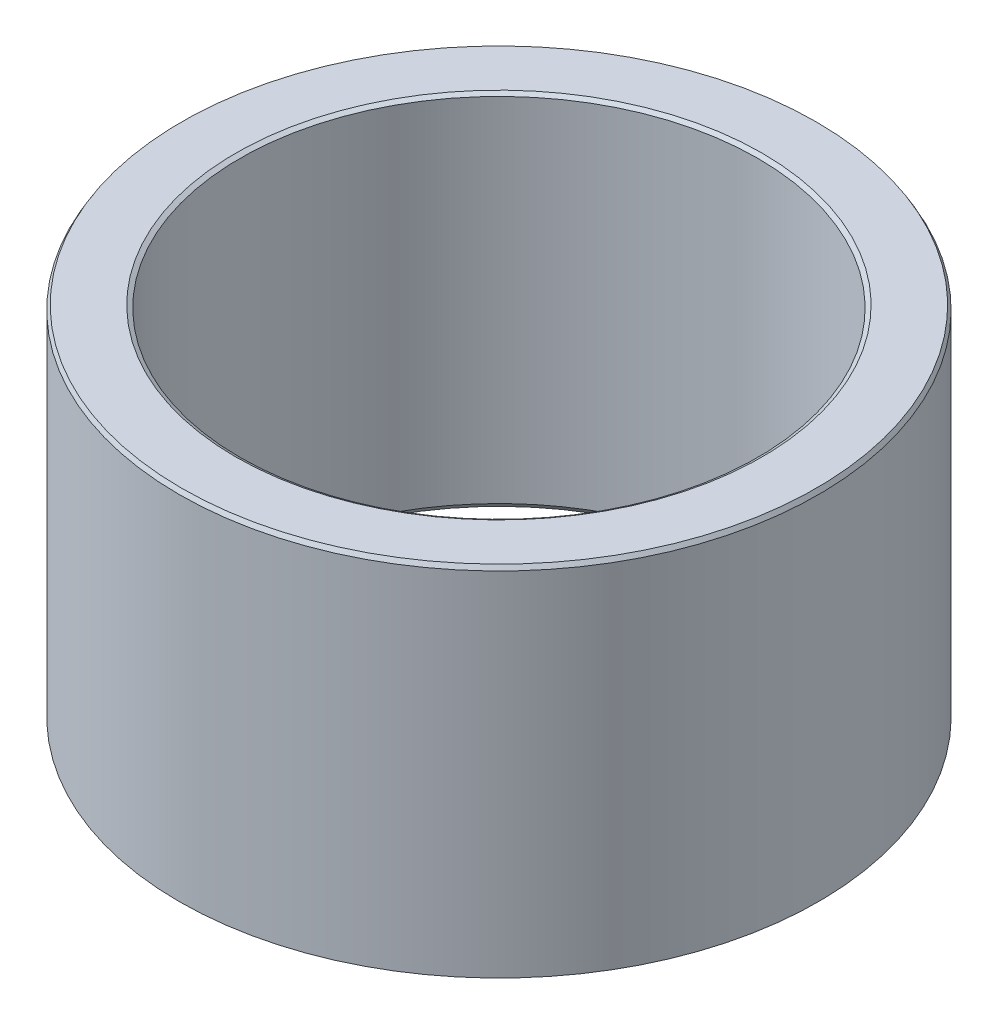
ISO-10303-21;
HEADER;
FILE_DESCRIPTION(('STEP AP214'),'2;1');
FILE_NAME('part.step','',(''),(''),'','','');
FILE_SCHEMA(('AUTOMOTIVE_DESIGN { 1 0 10303 214 1 1 1 1 }'));
ENDSEC;
DATA;
#1=APPLICATION_CONTEXT('core data for automotive mechanical design processes');
#2=APPLICATION_PROTOCOL_DEFINITION('international standard','automotive_design',2000,#1);
#3=PRODUCT_CONTEXT('',#1,'mechanical');
#4=PRODUCT('Part','Part','',(#3));
#5=PRODUCT_RELATED_PRODUCT_CATEGORY('part','',(#4));
#6=PRODUCT_DEFINITION_FORMATION('','',#4);
#7=PRODUCT_DEFINITION_CONTEXT('part definition',#1,'design');
#8=PRODUCT_DEFINITION('design','',#6,#7);
#9=PRODUCT_DEFINITION_SHAPE('','',#8);
#10=(LENGTH_UNIT() NAMED_UNIT(*) SI_UNIT(.MILLI.,.METRE.));
#11=(NAMED_UNIT(*) PLANE_ANGLE_UNIT() SI_UNIT($,.RADIAN.));
#12=(NAMED_UNIT(*) SI_UNIT($,.STERADIAN.) SOLID_ANGLE_UNIT());
#13=UNCERTAINTY_MEASURE_WITH_UNIT(LENGTH_MEASURE(1.E-05),#10,'distance_accuracy_value','');
#14=(GEOMETRIC_REPRESENTATION_CONTEXT(3) GLOBAL_UNCERTAINTY_ASSIGNED_CONTEXT((#13)) GLOBAL_UNIT_ASSIGNED_CONTEXT((#10,
#11,#12)) REPRESENTATION_CONTEXT('',''));
#15=CARTESIAN_POINT('',(0.,0.,0.));
#16=DIRECTION('',(0.,0.,1.));
#17=DIRECTION('',(1.,0.,0.));
#18=AXIS2_PLACEMENT_3D('',#15,#16,#17);
#19=CARTESIAN_POINT('',(0.,33.7031677071951,0.));
#20=DIRECTION('',(0.,-1.,0.));
#21=DIRECTION('',(0.,0.,-1.));
#22=AXIS2_PLACEMENT_3D('',#19,#20,#21);
#23=CYLINDRICAL_SURFACE('',#22,30.);
#24=CARTESIAN_POINT('',(0.,0.229181068101957,0.));
#25=DIRECTION('',(0.,1.,0.));
#26=DIRECTION('',(0.,0.,1.));
#27=AXIS2_PLACEMENT_3D('',#24,#25,#26);
#28=CIRCLE('',#27,30.);
#29=CARTESIAN_POINT('',(0.,0.229181068101957,30.));
#30=VERTEX_POINT('',#29);
#31=EDGE_CURVE('E10',#30,#30,#28,.T.);
#32=ORIENTED_EDGE('',*,*,#31,.T.);
#33=EDGE_LOOP('',(#32));
#34=FACE_BOUND('',#33,.T.);
#35=CARTESIAN_POINT('',(0.,33.3062144531096,0.));
#36=DIRECTION('',(0.,1.,0.));
#37=DIRECTION('',(0.,0.,1.));
#38=AXIS2_PLACEMENT_3D('',#35,#36,#37);
#39=CIRCLE('',#38,30.);
#40=CARTESIAN_POINT('',(0.,33.3062144531096,30.));
#41=VERTEX_POINT('',#40);
#42=EDGE_CURVE('E50',#41,#41,#39,.F.);
#43=ORIENTED_EDGE('',*,*,#42,.T.);
#44=EDGE_LOOP('',(#43));
#45=FACE_BOUND('',#44,.T.);
#46=ADVANCED_FACE('F39',(#34,#45),#23,.T.);
#47=CARTESIAN_POINT('',(0.,33.7031677071951,0.));
#48=DIRECTION('',(0.,1.,0.));
#49=DIRECTION('',(0.,0.,1.));
#50=AXIS2_PLACEMENT_3D('',#47,#48,#49);
#51=PLANE('',#50);
#52=CARTESIAN_POINT('',(0.,33.7031677071951,0.));
#53=DIRECTION('',(0.,1.,0.));
#54=DIRECTION('',(0.,0.,1.));
#55=AXIS2_PLACEMENT_3D('',#52,#53,#54);
#56=CIRCLE('',#55,24.6934247144909);
#57=CARTESIAN_POINT('',(0.,33.7031677071951,24.6934247144909));
#58=VERTEX_POINT('',#57);
#59=EDGE_CURVE('E58',#58,#58,#56,.F.);
#60=ORIENTED_EDGE('',*,*,#59,.T.);
#61=EDGE_LOOP('',(#60));
#62=FACE_BOUND('',#61,.T.);
#63=CARTESIAN_POINT('',(0.,33.7031677071951,0.));
#64=DIRECTION('',(0.,1.,0.));
#65=DIRECTION('',(0.,0.,1.));
#66=AXIS2_PLACEMENT_3D('',#63,#64,#65);
#67=CIRCLE('',#66,29.770818931898);
#68=CARTESIAN_POINT('',(0.,33.7031677071951,29.770818931898));
#69=VERTEX_POINT('',#68);
#70=EDGE_CURVE('E61',#69,#69,#67,.T.);
#71=ORIENTED_EDGE('',*,*,#70,.T.);
#72=EDGE_LOOP('',(#71));
#73=FACE_BOUND('',#72,.T.);
#74=ADVANCED_FACE('F88',(#62,#73),#51,.T.);
#75=CARTESIAN_POINT('',(0.,0.,0.));
#76=DIRECTION('',(0.,1.,0.));
#77=DIRECTION('',(0.,0.,1.));
#78=AXIS2_PLACEMENT_3D('',#75,#76,#77);
#79=PLANE('',#78);
#80=CARTESIAN_POINT('',(0.,0.,0.));
#81=DIRECTION('',(0.,1.,0.));
#82=DIRECTION('',(0.,0.,1.));
#83=AXIS2_PLACEMENT_3D('',#80,#81,#82);
#84=CIRCLE('',#83,24.5256525285073);
#85=CARTESIAN_POINT('',(0.,0.,24.5256525285073));
#86=VERTEX_POINT('',#85);
#87=EDGE_CURVE('E51',#86,#86,#84,.T.);
#88=ORIENTED_EDGE('',*,*,#87,.T.);
#89=EDGE_LOOP('',(#88));
#90=FACE_BOUND('',#89,.T.);
#91=CARTESIAN_POINT('',(0.,0.,0.));
#92=DIRECTION('',(0.,1.,0.));
#93=DIRECTION('',(0.,0.,1.));
#94=AXIS2_PLACEMENT_3D('',#91,#92,#93);
#95=CIRCLE('',#94,29.6030467459145);
#96=CARTESIAN_POINT('',(0.,0.,29.6030467459145));
#97=VERTEX_POINT('',#96);
#98=EDGE_CURVE('E54',#97,#97,#95,.F.);
#99=ORIENTED_EDGE('',*,*,#98,.T.);
#100=EDGE_LOOP('',(#99));
#101=FACE_BOUND('',#100,.T.);
#102=ADVANCED_FACE('F83',(#90,#101),#79,.F.);
#103=CARTESIAN_POINT('',(0.,33.7031677071951,0.));
#104=DIRECTION('',(0.,-1.,0.));
#105=DIRECTION('',(0.,0.,-1.));
#106=AXIS2_PLACEMENT_3D('',#103,#104,#105);
#107=CYLINDRICAL_SURFACE('',#106,24.2964714604053);
#108=CARTESIAN_POINT('',(0.,33.4739866390932,0.));
#109=DIRECTION('',(0.,1.,0.));
#110=DIRECTION('',(0.,0.,1.));
#111=AXIS2_PLACEMENT_3D('',#108,#109,#110);
#112=CIRCLE('',#111,24.2964714604053);
#113=CARTESIAN_POINT('',(0.,33.4739866390932,24.2964714604053));
#114=VERTEX_POINT('',#113);
#115=EDGE_CURVE('E67',#114,#114,#112,.T.);
#116=ORIENTED_EDGE('',*,*,#115,.T.);
#117=EDGE_LOOP('',(#116));
#118=FACE_BOUND('',#117,.T.);
#119=CARTESIAN_POINT('',(0.,0.396953254085508,0.));
#120=DIRECTION('',(0.,1.,0.));
#121=DIRECTION('',(0.,0.,1.));
#122=AXIS2_PLACEMENT_3D('',#119,#120,#121);
#123=CIRCLE('',#122,24.2964714604053);
#124=CARTESIAN_POINT('',(0.,0.396953254085508,24.2964714604053));
#125=VERTEX_POINT('',#124);
#126=EDGE_CURVE('E69',#125,#125,#123,.F.);
#127=ORIENTED_EDGE('',*,*,#126,.T.);
#128=EDGE_LOOP('',(#127));
#129=FACE_BOUND('',#128,.T.);
#130=ADVANCED_FACE('F71',(#118,#129),#107,.F.);
#131=CARTESIAN_POINT('',(0.,33.4739866390932,0.));
#132=DIRECTION('',(0.,1.,0.));
#133=DIRECTION('',(0.,0.,1.));
#134=AXIS2_PLACEMENT_3D('',#131,#132,#133);
#135=CONICAL_SURFACE('',#134,24.2964714604053,1.0471975511966);
#136=CARTESIAN_POINT('',(0.,33.7031677071951,24.6934247144909));
#137=CARTESIAN_POINT('',(0.,33.7007804044024,24.6892897847608));
#138=CARTESIAN_POINT('',(0.,33.6983931016097,24.6851548550307));
#139=CARTESIAN_POINT('',(0.,33.6936184960242,24.6768849955706));
#140=CARTESIAN_POINT('',(0.,33.6912311932315,24.6727500658406));
#141=CARTESIAN_POINT('',(0.,33.686456587646,24.6644802063804));
#142=CARTESIAN_POINT('',(0.,33.6840692848533,24.6603452766504));
#143=CARTESIAN_POINT('',(0.,33.6792946792679,24.6520754171903));
#144=CARTESIAN_POINT('',(0.,33.6769073764751,24.6479404874602));
#145=CARTESIAN_POINT('',(0.,33.6721327708897,24.6396706280001));
#146=CARTESIAN_POINT('',(0.,33.6697454680969,24.6355356982701));
#147=CARTESIAN_POINT('',(0.,33.6649708625115,24.6272658388099));
#148=CARTESIAN_POINT('',(0.,33.6625835597188,24.6231309090799));
#149=CARTESIAN_POINT('',(0.,33.6578089541333,24.6148610496198));
#150=CARTESIAN_POINT('',(0.,33.6554216513406,24.6107261198897));
#151=CARTESIAN_POINT('',(0.,33.6506470457551,24.6024562604296));
#152=CARTESIAN_POINT('',(0.,33.6482597429624,24.5983213306995));
#153=CARTESIAN_POINT('',(0.,33.6434851373769,24.5900514712394));
#154=CARTESIAN_POINT('',(0.,33.6410978345842,24.5859165415094));
#155=CARTESIAN_POINT('',(0.,33.6363232289987,24.5776466820492));
#156=CARTESIAN_POINT('',(0.,33.633935926206,24.5735117523192));
#157=CARTESIAN_POINT('',(0.,33.6291613206205,24.5652418928591));
#158=CARTESIAN_POINT('',(0.,33.6267740178278,24.561106963129));
#159=CARTESIAN_POINT('',(0.,33.6219994122424,24.5528371036689));
#160=CARTESIAN_POINT('',(0.,33.6196121094496,24.5487021739388));
#161=CARTESIAN_POINT('',(0.,33.6148375038642,24.5404323144787));
#162=CARTESIAN_POINT('',(0.,33.6124502010714,24.5362973847487));
#163=CARTESIAN_POINT('',(0.,33.607675595486,24.5280275252885));
#164=CARTESIAN_POINT('',(0.,33.6052882926933,24.5238925955585));
#165=CARTESIAN_POINT('',(0.,33.6005136871078,24.5156227360984));
#166=CARTESIAN_POINT('',(0.,33.5981263843151,24.5114878063683));
#167=CARTESIAN_POINT('',(0.,33.5933517787296,24.5032179469082));
#168=CARTESIAN_POINT('',(0.,33.5909644759369,24.4990830171781));
#169=CARTESIAN_POINT('',(0.,33.5861898703514,24.490813157718));
#170=CARTESIAN_POINT('',(0.,33.5838025675587,24.486678227988));
#171=CARTESIAN_POINT('',(0.,33.5790279619732,24.4784083685279));
#172=CARTESIAN_POINT('',(0.,33.5766406591805,24.4742734387978));
#173=CARTESIAN_POINT('',(0.,33.5718660535951,24.4660035793377));
#174=CARTESIAN_POINT('',(0.,33.5694787508023,24.4618686496076));
#175=CARTESIAN_POINT('',(0.,33.5647041452169,24.4535987901475));
#176=CARTESIAN_POINT('',(0.,33.5623168424241,24.4494638604174));
#177=CARTESIAN_POINT('',(0.,33.5575422368387,24.4411940009573));
#178=CARTESIAN_POINT('',(0.,33.555154934046,24.4370590712273));
#179=CARTESIAN_POINT('',(0.,33.5503803284605,24.4287892117672));
#180=CARTESIAN_POINT('',(0.,33.5479930256678,24.4246542820371));
#181=CARTESIAN_POINT('',(0.,33.5432184200823,24.416384422577));
#182=CARTESIAN_POINT('',(0.,33.5408311172896,24.4122494928469));
#183=CARTESIAN_POINT('',(0.,33.5360565117041,24.4039796333868));
#184=CARTESIAN_POINT('',(0.,33.5336692089114,24.3998447036568));
#185=CARTESIAN_POINT('',(0.,33.5288946033259,24.3915748441966));
#186=CARTESIAN_POINT('',(0.,33.5265073005332,24.3874399144666));
#187=CARTESIAN_POINT('',(0.,33.5217326949477,24.3791700550065));
#188=CARTESIAN_POINT('',(0.,33.519345392155,24.3750351252764));
#189=CARTESIAN_POINT('',(0.,33.5145707865695,24.3667652658163));
#190=CARTESIAN_POINT('',(0.,33.5121834837768,24.3626303360862));
#191=CARTESIAN_POINT('',(0.,33.5074088781914,24.3543604766261));
#192=CARTESIAN_POINT('',(0.,33.5050215753986,24.3502255468961));
#193=CARTESIAN_POINT('',(0.,33.5002469698132,24.3419556874359));
#194=CARTESIAN_POINT('',(0.,33.4978596670204,24.3378207577059));
#195=CARTESIAN_POINT('',(0.,33.493085061435,24.3295508982458));
#196=CARTESIAN_POINT('',(0.,33.4906977586423,24.3254159685157));
#197=CARTESIAN_POINT('',(0.,33.4859231530568,24.3171461090556));
#198=CARTESIAN_POINT('',(0.,33.4835358502641,24.3130111793255));
#199=CARTESIAN_POINT('',(0.,33.4787612446786,24.3047413198654));
#200=CARTESIAN_POINT('',(0.,33.4763739418859,24.3006063901354));
#201=CARTESIAN_POINT('',(0.,33.4739866390932,24.2964714604053));
#202=B_SPLINE_CURVE_WITH_KNOTS('',3,(#136,#137,#138,#139,#140,#141,#142,#143,#144,#145,#146,
#147,#148,#149,#150,#151,#152,#153,#154,#155,#156,#157,#158,#159,#160,#161,#162,#163,#164,#165,
#166,#167,#168,#169,#170,#171,#172,#173,#174,#175,#176,#177,#178,#179,#180,#181,#182,#183,#184,
#185,#186,#187,#188,#189,#190,#191,#192,#193,#194,#195,#196,#197,#198,#199,#200,#201),
.UNSPECIFIED.,.F.,.F.,(4,2,2,2,2,2,2,2,2,2,2,2,2,2,2,2,2,2,2,2,2,2,2,2,2,2,2,2,2,2,2,2,4),(0.,
0.014323816756375,0.0286476335127465,0.0429714502691246,0.0572952670254961,0.0716190837818711,
0.0859429005382456,0.100266717294621,0.114590534050992,0.12891435080737,0.143238167563742,
0.157561984320117,0.171885801076488,0.186209617832866,0.200533434589238,0.214857251345613,
0.229181068101987,0.243504884858359,0.257828701614734,0.272152518371108,0.286476335127483,
0.300800151883855,0.315123968640233,0.329447785396604,0.343771602152979,0.358095418909354,
0.372419235665729,0.3867430524221,0.401066869178476,0.41539068593485,0.429714502691225,
0.444038319447597,0.458362136203971),.UNSPECIFIED.);
#203=EDGE_CURVE('BSEAM77',#58,#114,#202,.T.);
#204=ORIENTED_EDGE('',*,*,#59,.F.);
#205=ORIENTED_EDGE('',*,*,#115,.F.);
#206=ORIENTED_EDGE('',*,*,#203,.T.);
#207=ORIENTED_EDGE('',*,*,#203,.F.);
#208=EDGE_LOOP('',(#204,#206,#205,#207));
#209=FACE_BOUND('',#208,.T.);
#210=ADVANCED_FACE('F77',(#209),#135,.F.);
#211=CARTESIAN_POINT('',(0.,0.,0.));
#212=DIRECTION('',(0.,-1.,0.));
#213=DIRECTION('',(0.,0.,-1.));
#214=AXIS2_PLACEMENT_3D('',#211,#212,#213);
#215=CONICAL_SURFACE('',#214,24.5256525285073,0.523598775598307);
#216=ORIENTED_EDGE('',*,*,#126,.F.);
#217=EDGE_LOOP('',(#216));
#218=FACE_BOUND('',#217,.T.);
#219=ORIENTED_EDGE('',*,*,#87,.F.);
#220=EDGE_LOOP('',(#219));
#221=FACE_BOUND('',#220,.T.);
#222=ADVANCED_FACE('F73',(#218,#221),#215,.F.);
#223=CARTESIAN_POINT('',(0.,0.229181068101957,0.));
#224=DIRECTION('',(0.,1.,0.));
#225=DIRECTION('',(0.,0.,1.));
#226=AXIS2_PLACEMENT_3D('',#223,#224,#225);
#227=CONICAL_SURFACE('',#226,30.,1.0471975511966);
#228=CARTESIAN_POINT('',(0.,0.,29.6030467459145));
#229=CARTESIAN_POINT('',(0.,0.0023873027927286,29.6071816756446));
#230=CARTESIAN_POINT('',(0.,0.00477460558545735,29.6113166053746));
#231=CARTESIAN_POINT('',(0.,0.00954921117091487,29.6195864648347));
#232=CARTESIAN_POINT('',(0.,0.0119365139636436,29.6237213945648));
#233=CARTESIAN_POINT('',(0.,0.0167111195491009,29.6319912540249));
#234=CARTESIAN_POINT('',(0.,0.0190984223418294,29.636126183755));
#235=CARTESIAN_POINT('',(0.,0.0238730279272869,29.6443960432151));
#236=CARTESIAN_POINT('',(0.,0.026260330720016,29.6485309729451));
#237=CARTESIAN_POINT('',(0.,0.0310349363054736,29.6568008324052));
#238=CARTESIAN_POINT('',(0.,0.0334222390982021,29.6609357621353));
#239=CARTESIAN_POINT('',(0.,0.0381968446836593,29.6692056215954));
#240=CARTESIAN_POINT('',(0.,0.0405841474763881,29.6733405513255));
#241=CARTESIAN_POINT('',(0.,0.0453587530618456,29.6816104107856));
#242=CARTESIAN_POINT('',(0.,0.0477460558545743,29.6857453405156));
#243=CARTESIAN_POINT('',(0.,0.0525206614400317,29.6940151999758));
#244=CARTESIAN_POINT('',(0.,0.0549079642327604,29.6981501297058));
#245=CARTESIAN_POINT('',(0.,0.0596825698182178,29.7064199891659));
#246=CARTESIAN_POINT('',(0.,0.0620698726109465,29.710554918896));
#247=CARTESIAN_POINT('',(0.,0.066844478196404,29.7188247783561));
#248=CARTESIAN_POINT('',(0.,0.0692317809891328,29.7229597080862));
#249=CARTESIAN_POINT('',(0.,0.07400638657459,29.7312295675463));
#250=CARTESIAN_POINT('',(0.,0.0763936893673185,29.7353644972763));
#251=CARTESIAN_POINT('',(0.,0.0811682949527761,29.7436343567365));
#252=CARTESIAN_POINT('',(0.,0.0835555977455052,29.7477692864665));
#253=CARTESIAN_POINT('',(0.,0.0883302033309627,29.7560391459266));
#254=CARTESIAN_POINT('',(0.,0.0907175061236912,29.7601740756567));
#255=CARTESIAN_POINT('',(0.,0.0954921117091485,29.7684439351168));
#256=CARTESIAN_POINT('',(0.,0.0978794145018773,29.7725788648469));
#257=CARTESIAN_POINT('',(0.,0.102654020087335,29.780848724307));
#258=CARTESIAN_POINT('',(0.,0.105041322880063,29.784983654037));
#259=CARTESIAN_POINT('',(0.,0.109815928465521,29.7932535134971));
#260=CARTESIAN_POINT('',(0.,0.11220323125825,29.7973884432272));
#261=CARTESIAN_POINT('',(0.,0.116977836843707,29.8056583026873));
#262=CARTESIAN_POINT('',(0.,0.119365139636436,29.8097932324174));
#263=CARTESIAN_POINT('',(0.,0.124139745221893,29.8180630918775));
#264=CARTESIAN_POINT('',(0.,0.126527048014622,29.8221980216075));
#265=CARTESIAN_POINT('',(0.,0.131301653600079,29.8304678810677));
#266=CARTESIAN_POINT('',(0.,0.133688956392808,29.8346028107977));
#267=CARTESIAN_POINT('',(0.,0.138463561978265,29.8428726702578));
#268=CARTESIAN_POINT('',(0.,0.140850864770994,29.8470075999879));
#269=CARTESIAN_POINT('',(0.,0.145625470356452,29.855277459448));
#270=CARTESIAN_POINT('',(0.,0.14801277314918,29.8594123891781));
#271=CARTESIAN_POINT('',(0.,0.152787378734638,29.8676822486382));
#272=CARTESIAN_POINT('',(0.,0.155174681527366,29.8718171783682));
#273=CARTESIAN_POINT('',(0.,0.159949287112824,29.8800870378283));
#274=CARTESIAN_POINT('',(0.,0.162336589905553,29.8842219675584));
#275=CARTESIAN_POINT('',(0.,0.16711119549101,29.8924918270185));
#276=CARTESIAN_POINT('',(0.,0.169498498283739,29.8966267567486));
#277=CARTESIAN_POINT('',(0.,0.174273103869196,29.9048966162087));
#278=CARTESIAN_POINT('',(0.,0.176660406661925,29.9090315459387));
#279=CARTESIAN_POINT('',(0.,0.181435012247382,29.9173014053989));
#280=CARTESIAN_POINT('',(0.,0.183822315040111,29.9214363351289));
#281=CARTESIAN_POINT('',(0.,0.188596920625568,29.929706194589));
#282=CARTESIAN_POINT('',(0.,0.190984223418297,29.9338411243191));
#283=CARTESIAN_POINT('',(0.,0.195758829003754,29.9421109837792));
#284=CARTESIAN_POINT('',(0.,0.198146131796483,29.9462459135093));
#285=CARTESIAN_POINT('',(0.,0.202920737381941,29.9545157729694));
#286=CARTESIAN_POINT('',(0.,0.205308040174669,29.9586507026994));
#287=CARTESIAN_POINT('',(0.,0.210082645760127,29.9669205621595));
#288=CARTESIAN_POINT('',(0.,0.212469948552856,29.9710554918896));
#289=CARTESIAN_POINT('',(0.,0.217244554138313,29.9793253513497));
#290=CARTESIAN_POINT('',(0.,0.219631856931042,29.9834602810798));
#291=CARTESIAN_POINT('',(0.,0.224406462516499,29.9917301405399));
#292=CARTESIAN_POINT('',(0.,0.226793765309228,29.9958650702699));
#293=CARTESIAN_POINT('',(0.,0.229181068101957,30.));
#294=B_SPLINE_CURVE_WITH_KNOTS('',3,(#228,#229,#230,#231,#232,#233,#234,#235,#236,#237,#238,
#239,#240,#241,#242,#243,#244,#245,#246,#247,#248,#249,#250,#251,#252,#253,#254,#255,#256,#257,
#258,#259,#260,#261,#262,#263,#264,#265,#266,#267,#268,#269,#270,#271,#272,#273,#274,#275,#276,
#277,#278,#279,#280,#281,#282,#283,#284,#285,#286,#287,#288,#289,#290,#291,#292,#293),
.UNSPECIFIED.,.F.,.F.,(4,2,2,2,2,2,2,2,2,2,2,2,2,2,2,2,2,2,2,2,2,2,2,2,2,2,2,2,2,2,2,2,4),(0.,
0.0143238167563727,0.0286476335127455,0.0429714502691182,0.0572952670254879,0.0716190837818606,
0.0859429005382334,0.100266717294606,0.114590534050979,0.128914350807352,0.143238167563724,
0.157561984320097,0.171885801076467,0.186209617832839,0.200533434589212,0.214857251345585,
0.229181068101958,0.24350488485833,0.257828701614703,0.272152518371076,0.286476335127446,
0.300800151883818,0.315123968640191,0.329447785396564,0.343771602152936,0.358095418909309,
0.372419235665682,0.386743052422055,0.401066869178424,0.415390685934797,0.42971450269117,
0.444038319447542,0.458362136203915),.UNSPECIFIED.);
#295=EDGE_CURVE('BSEAM76',#97,#30,#294,.T.);
#296=ORIENTED_EDGE('',*,*,#98,.F.);
#297=ORIENTED_EDGE('',*,*,#31,.F.);
#298=ORIENTED_EDGE('',*,*,#295,.T.);
#299=ORIENTED_EDGE('',*,*,#295,.F.);
#300=EDGE_LOOP('',(#296,#298,#297,#299));
#301=FACE_BOUND('',#300,.T.);
#302=ADVANCED_FACE('F76',(#301),#227,.T.);
#303=CARTESIAN_POINT('',(0.,33.7031677071951,0.));
#304=DIRECTION('',(0.,-1.,0.));
#305=DIRECTION('',(0.,0.,-1.));
#306=AXIS2_PLACEMENT_3D('',#303,#304,#305);
#307=CONICAL_SURFACE('',#306,29.770818931898,0.523598775598309);
#308=ORIENTED_EDGE('',*,*,#42,.F.);
#309=EDGE_LOOP('',(#308));
#310=FACE_BOUND('',#309,.T.);
#311=ORIENTED_EDGE('',*,*,#70,.F.);
#312=EDGE_LOOP('',(#311));
#313=FACE_BOUND('',#312,.T.);
#314=ADVANCED_FACE('F45',(#310,#313),#307,.T.);
#315=CLOSED_SHELL('',(#46,#74,#102,#130,#210,#222,#302,#314));
#316=MANIFOLD_SOLID_BREP('B2',#315);
#317=ADVANCED_BREP_SHAPE_REPRESENTATION('',(#18,#316),#14);
#318=SHAPE_DEFINITION_REPRESENTATION(#9,#317);
ENDSEC;
END-ISO-10303-21;
